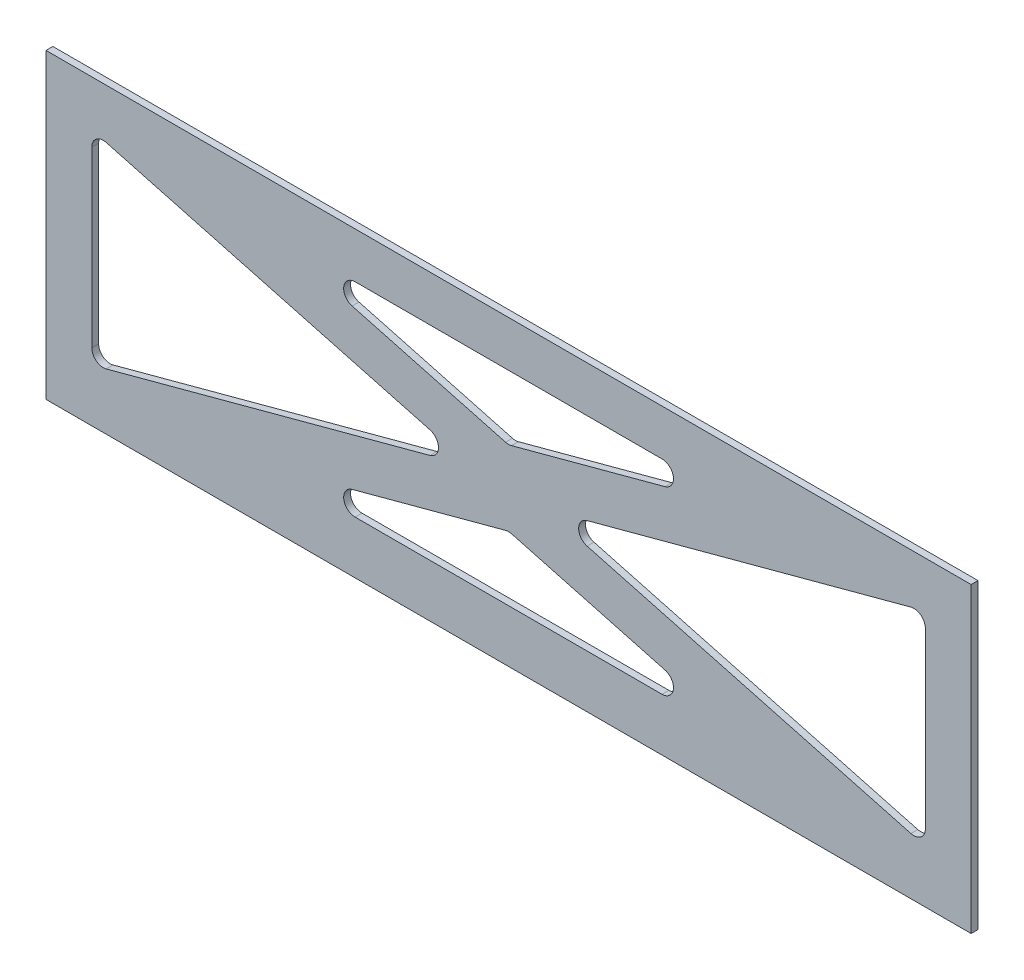
ISO-10303-21;
HEADER;
FILE_DESCRIPTION(('STEP AP214'),'2;1');
FILE_NAME('part.step','',(''),(''),'','','');
FILE_SCHEMA(('AUTOMOTIVE_DESIGN { 1 0 10303 214 1 1 1 1 }'));
ENDSEC;
DATA;
#1=APPLICATION_CONTEXT('core data for automotive mechanical design processes');
#2=APPLICATION_PROTOCOL_DEFINITION('international standard','automotive_design',2000,#1);
#3=PRODUCT_CONTEXT('',#1,'mechanical');
#4=PRODUCT('Part','Part','',(#3));
#5=PRODUCT_RELATED_PRODUCT_CATEGORY('part','',(#4));
#6=PRODUCT_DEFINITION_FORMATION('','',#4);
#7=PRODUCT_DEFINITION_CONTEXT('part definition',#1,'design');
#8=PRODUCT_DEFINITION('design','',#6,#7);
#9=PRODUCT_DEFINITION_SHAPE('','',#8);
#10=(LENGTH_UNIT() NAMED_UNIT(*) SI_UNIT(.MILLI.,.METRE.));
#11=(NAMED_UNIT(*) PLANE_ANGLE_UNIT() SI_UNIT($,.RADIAN.));
#12=(NAMED_UNIT(*) SI_UNIT($,.STERADIAN.) SOLID_ANGLE_UNIT());
#13=UNCERTAINTY_MEASURE_WITH_UNIT(LENGTH_MEASURE(1.E-05),#10,'distance_accuracy_value','');
#14=(GEOMETRIC_REPRESENTATION_CONTEXT(3) GLOBAL_UNCERTAINTY_ASSIGNED_CONTEXT((#13)) GLOBAL_UNIT_ASSIGNED_CONTEXT((#10,
#11,#12)) REPRESENTATION_CONTEXT('',''));
#15=CARTESIAN_POINT('',(0.,0.,0.));
#16=DIRECTION('',(0.,0.,1.));
#17=DIRECTION('',(1.,0.,0.));
#18=AXIS2_PLACEMENT_3D('',#15,#16,#17);
#19=CARTESIAN_POINT('',(0.,0.,154.999999999998));
#20=DIRECTION('',(0.,0.,1.));
#21=DIRECTION('',(1.,0.,0.));
#22=AXIS2_PLACEMENT_3D('',#19,#20,#21);
#23=PLANE('',#22);
#24=DIRECTION('',(0.,-1.,0.));
#25=VECTOR('',#24,1.);
#26=CARTESIAN_POINT('',(-116.473418032142,-3.40919867975124,154.999999999998));
#27=LINE('',#26,#25);
#28=CARTESIAN_POINT('',(-116.473418032142,-3.40919867975124,154.999999999998));
#29=VERTEX_POINT('',#28);
#30=CARTESIAN_POINT('',(-116.473418032142,-135.409198679751,154.999999999998));
#31=VERTEX_POINT('',#30);
#32=EDGE_CURVE('E407',#29,#31,#27,.T.);
#33=ORIENTED_EDGE('',*,*,#32,.T.);
#34=DIRECTION('',(1.,0.,0.));
#35=VECTOR('',#34,1.);
#36=CARTESIAN_POINT('',(-116.473418032142,-135.409198679751,154.999999999998));
#37=LINE('',#36,#35);
#38=CARTESIAN_POINT('',(287.526581967859,-135.409198679751,154.999999999998));
#39=VERTEX_POINT('',#38);
#40=EDGE_CURVE('E410',#31,#39,#37,.T.);
#41=ORIENTED_EDGE('',*,*,#40,.T.);
#42=DIRECTION('',(0.,1.,0.));
#43=VECTOR('',#42,1.);
#44=CARTESIAN_POINT('',(287.526581967859,-3.40919867975124,154.999999999998));
#45=LINE('',#44,#43);
#46=CARTESIAN_POINT('',(287.526581967859,-3.40919867975124,154.999999999998));
#47=VERTEX_POINT('',#46);
#48=EDGE_CURVE('E413',#39,#47,#45,.T.);
#49=ORIENTED_EDGE('',*,*,#48,.T.);
#50=DIRECTION('',(-1.,0.,0.));
#51=VECTOR('',#50,1.);
#52=CARTESIAN_POINT('',(-116.473418032142,-3.40919867975124,154.999999999998));
#53=LINE('',#52,#51);
#54=EDGE_CURVE('E415',#47,#29,#53,.T.);
#55=ORIENTED_EDGE('',*,*,#54,.T.);
#56=EDGE_LOOP('',(#33,#41,#49,#55));
#57=FACE_BOUND('',#56,.T.);
#58=DIRECTION('',(0.965769259558436,0.25940265475116,0.));
#59=VECTOR('',#58,1.);
#60=CARTESIAN_POINT('',(51.2243022304493,-72.7380449775434,154.999999999998));
#61=LINE('',#60,#59);
#62=CARTESIAN_POINT('',(-90.1764047583858,-110.717840268776,154.999999999998));
#63=VERTEX_POINT('',#62);
#64=CARTESIAN_POINT('',(51.2243022304493,-72.7380449775434,154.999999999998));
#65=VERTEX_POINT('',#64);
#66=EDGE_CURVE('E364',#63,#65,#61,.T.);
#67=ORIENTED_EDGE('',*,*,#66,.F.);
#68=CARTESIAN_POINT('',(-91.4734180321416,-105.888993970984,154.999999999998));
#69=DIRECTION('',(0.,0.,1.));
#70=DIRECTION('',(-1.,0.,0.));
#71=AXIS2_PLACEMENT_3D('',#68,#69,#70);
#72=CIRCLE('',#71,5.00000000000001);
#73=CARTESIAN_POINT('',(-96.4734180321416,-105.888993970984,154.999999999998));
#74=VERTEX_POINT('',#73);
#75=EDGE_CURVE('E362',#74,#63,#72,.T.);
#76=ORIENTED_EDGE('',*,*,#75,.F.);
#77=DIRECTION('',(0.,-1.,0.));
#78=VECTOR('',#77,1.);
#79=CARTESIAN_POINT('',(-96.4734180321416,-105.888993970984,154.999999999998));
#80=LINE('',#79,#78);
#81=CARTESIAN_POINT('',(-96.4734180321416,-29.9294033885187,154.999999999998));
#82=VERTEX_POINT('',#81);
#83=EDGE_CURVE('E374',#82,#74,#80,.T.);
#84=ORIENTED_EDGE('',*,*,#83,.F.);
#85=CARTESIAN_POINT('',(-91.4734180321416,-29.9294033885187,154.999999999998));
#86=DIRECTION('',(0.,0.,1.));
#87=DIRECTION('',(1.,0.,0.));
#88=AXIS2_PLACEMENT_3D('',#85,#86,#87);
#89=CIRCLE('',#88,5.00000000000001);
#90=CARTESIAN_POINT('',(-90.1764047583858,-25.1005570907265,154.999999999998));
#91=VERTEX_POINT('',#90);
#92=EDGE_CURVE('E371',#91,#82,#89,.T.);
#93=ORIENTED_EDGE('',*,*,#92,.F.);
#94=DIRECTION('',(-0.965769259558436,0.25940265475116,0.));
#95=VECTOR('',#94,1.);
#96=CARTESIAN_POINT('',(-90.1764047583858,-25.1005570907265,154.999999999998));
#97=LINE('',#96,#95);
#98=CARTESIAN_POINT('',(51.2243022304493,-63.0803523819591,154.999999999998));
#99=VERTEX_POINT('',#98);
#100=EDGE_CURVE('E369',#99,#91,#97,.T.);
#101=ORIENTED_EDGE('',*,*,#100,.F.);
#102=CARTESIAN_POINT('',(49.9272889566935,-67.9091986797513,154.999999999998));
#103=DIRECTION('',(0.,0.,1.));
#104=DIRECTION('',(1.,0.,0.));
#105=AXIS2_PLACEMENT_3D('',#102,#103,#104);
#106=CIRCLE('',#105,5.);
#107=EDGE_CURVE('E367',#65,#99,#106,.T.);
#108=ORIENTED_EDGE('',*,*,#107,.F.);
#109=EDGE_LOOP('',(#67,#76,#84,#93,#101,#108));
#110=FACE_BOUND('',#109,.T.);
#111=DIRECTION('',(-0.965769259558436,0.259402654751159,0.));
#112=VECTOR('',#111,1.);
#113=CARTESIAN_POINT('',(86.8235952416147,-84.5818121562467,154.999999999998));
#114=LINE('',#113,#112);
#115=CARTESIAN_POINT('',(153.833074707404,-102.580352381959,154.999999999998));
#116=VERTEX_POINT('',#115);
#117=CARTESIAN_POINT('',(86.8235952416147,-84.5818121562467,154.999999999998));
#118=VERTEX_POINT('',#117);
#119=EDGE_CURVE('E319',#116,#118,#114,.T.);
#120=ORIENTED_EDGE('',*,*,#119,.F.);
#121=CARTESIAN_POINT('',(152.536061433648,-107.409198679751,154.999999999998));
#122=DIRECTION('',(0.,0.,1.));
#123=DIRECTION('',(-1.,0.,0.));
#124=AXIS2_PLACEMENT_3D('',#121,#122,#123);
#125=CIRCLE('',#124,5.00000000000001);
#126=CARTESIAN_POINT('',(152.536061433648,-112.409198679751,154.999999999998));
#127=VERTEX_POINT('',#126);
#128=EDGE_CURVE('E317',#127,#116,#125,.T.);
#129=ORIENTED_EDGE('',*,*,#128,.F.);
#130=DIRECTION('',(1.,0.,0.));
#131=VECTOR('',#130,1.);
#132=CARTESIAN_POINT('',(152.536061433648,-112.409198679751,154.999999999998));
#133=LINE('',#132,#131);
#134=CARTESIAN_POINT('',(18.51710250207,-112.409198679751,154.999999999998));
#135=VERTEX_POINT('',#134);
#136=EDGE_CURVE('E329',#135,#127,#133,.T.);
#137=ORIENTED_EDGE('',*,*,#136,.F.);
#138=CARTESIAN_POINT('',(18.51710250207,-107.409198679751,154.999999999998));
#139=DIRECTION('',(0.,0.,1.));
#140=DIRECTION('',(1.,0.,0.));
#141=AXIS2_PLACEMENT_3D('',#138,#139,#140);
#142=CIRCLE('',#141,4.99999999999999);
#143=CARTESIAN_POINT('',(17.2200892283142,-102.580352381959,154.999999999998));
#144=VERTEX_POINT('',#143);
#145=EDGE_CURVE('E326',#144,#135,#142,.T.);
#146=ORIENTED_EDGE('',*,*,#145,.F.);
#147=DIRECTION('',(-0.965769259558436,-0.25940265475116,0.));
#148=VECTOR('',#147,1.);
#149=CARTESIAN_POINT('',(17.2200892283142,-102.580352381959,154.999999999998));
#150=LINE('',#149,#148);
#151=CARTESIAN_POINT('',(84.2295686941031,-84.5818121562467,154.999999999998));
#152=VERTEX_POINT('',#151);
#153=EDGE_CURVE('E324',#152,#144,#150,.T.);
#154=ORIENTED_EDGE('',*,*,#153,.F.);
#155=CARTESIAN_POINT('',(85.5265819678589,-89.4106584540389,154.999999999998));
#156=DIRECTION('',(0.,0.,1.));
#157=DIRECTION('',(-1.,0.,0.));
#158=AXIS2_PLACEMENT_3D('',#155,#156,#157);
#159=CIRCLE('',#158,5.00000000000001);
#160=EDGE_CURVE('E322',#118,#152,#159,.T.);
#161=ORIENTED_EDGE('',*,*,#160,.F.);
#162=EDGE_LOOP('',(#120,#129,#137,#146,#154,#161));
#163=FACE_BOUND('',#162,.T.);
#164=DIRECTION('',(0.965769259558436,-0.25940265475116,0.));
#165=VECTOR('',#164,1.);
#166=CARTESIAN_POINT('',(119.828861705269,-72.7380449775434,154.999999999998));
#167=LINE('',#166,#165);
#168=CARTESIAN_POINT('',(119.828861705269,-72.7380449775434,154.999999999998));
#169=VERTEX_POINT('',#168);
#170=CARTESIAN_POINT('',(261.229568694104,-110.717840268776,154.999999999998));
#171=VERTEX_POINT('',#170);
#172=EDGE_CURVE('E274',#169,#171,#167,.T.);
#173=ORIENTED_EDGE('',*,*,#172,.F.);
#174=CARTESIAN_POINT('',(121.125874979025,-67.9091986797512,154.999999999998));
#175=DIRECTION('',(0.,0.,1.));
#176=DIRECTION('',(1.,0.,0.));
#177=AXIS2_PLACEMENT_3D('',#174,#175,#176);
#178=CIRCLE('',#177,4.99999999999999);
#179=CARTESIAN_POINT('',(119.828861705269,-63.0803523819591,154.999999999998));
#180=VERTEX_POINT('',#179);
#181=EDGE_CURVE('E272',#180,#169,#178,.T.);
#182=ORIENTED_EDGE('',*,*,#181,.F.);
#183=DIRECTION('',(-0.965769259558437,-0.25940265475116,0.));
#184=VECTOR('',#183,1.);
#185=CARTESIAN_POINT('',(261.229568694104,-25.1005570907265,154.999999999998));
#186=LINE('',#185,#184);
#187=CARTESIAN_POINT('',(261.229568694104,-25.1005570907266,154.999999999998));
#188=VERTEX_POINT('',#187);
#189=EDGE_CURVE('E284',#188,#180,#186,.T.);
#190=ORIENTED_EDGE('',*,*,#189,.F.);
#191=CARTESIAN_POINT('',(262.526581967859,-29.9294033885187,154.999999999998));
#192=DIRECTION('',(0.,0.,1.));
#193=DIRECTION('',(1.,0.,0.));
#194=AXIS2_PLACEMENT_3D('',#191,#192,#193);
#195=CIRCLE('',#194,4.99999999999998);
#196=CARTESIAN_POINT('',(267.526581967859,-29.9294033885187,154.999999999998));
#197=VERTEX_POINT('',#196);
#198=EDGE_CURVE('E281',#197,#188,#195,.T.);
#199=ORIENTED_EDGE('',*,*,#198,.F.);
#200=DIRECTION('',(0.,1.,0.));
#201=VECTOR('',#200,1.);
#202=CARTESIAN_POINT('',(267.526581967859,-105.888993970984,154.999999999998));
#203=LINE('',#202,#201);
#204=CARTESIAN_POINT('',(267.526581967859,-105.888993970984,154.999999999998));
#205=VERTEX_POINT('',#204);
#206=EDGE_CURVE('E279',#205,#197,#203,.T.);
#207=ORIENTED_EDGE('',*,*,#206,.F.);
#208=CARTESIAN_POINT('',(262.526581967859,-105.888993970984,154.999999999998));
#209=DIRECTION('',(0.,0.,1.));
#210=DIRECTION('',(1.,0.,0.));
#211=AXIS2_PLACEMENT_3D('',#208,#209,#210);
#212=CIRCLE('',#211,5.);
#213=EDGE_CURVE('E277',#171,#205,#212,.T.);
#214=ORIENTED_EDGE('',*,*,#213,.F.);
#215=EDGE_LOOP('',(#173,#182,#190,#199,#207,#214));
#216=FACE_BOUND('',#215,.T.);
#217=DIRECTION('',(0.965769259558436,-0.25940265475116,0.));
#218=VECTOR('',#217,1.);
#219=CARTESIAN_POINT('',(17.2200892283142,-33.2380449775434,154.999999999998));
#220=LINE('',#219,#218);
#221=CARTESIAN_POINT('',(17.2200892283142,-33.2380449775434,154.999999999998));
#222=VERTEX_POINT('',#221);
#223=CARTESIAN_POINT('',(84.2295686941031,-51.2365852032558,154.999999999998));
#224=VERTEX_POINT('',#223);
#225=EDGE_CURVE('E229',#222,#224,#220,.T.);
#226=ORIENTED_EDGE('',*,*,#225,.F.);
#227=CARTESIAN_POINT('',(18.51710250207,-28.4091986797512,154.999999999998));
#228=DIRECTION('',(0.,0.,1.));
#229=DIRECTION('',(-1.,0.,0.));
#230=AXIS2_PLACEMENT_3D('',#227,#228,#229);
#231=CIRCLE('',#230,4.99999999999999);
#232=CARTESIAN_POINT('',(18.51710250207,-23.4091986797512,154.999999999998));
#233=VERTEX_POINT('',#232);
#234=EDGE_CURVE('E221',#233,#222,#231,.T.);
#235=ORIENTED_EDGE('',*,*,#234,.F.);
#236=DIRECTION('',(-1.,0.,0.));
#237=VECTOR('',#236,1.);
#238=CARTESIAN_POINT('',(152.536061433648,-23.4091986797512,154.999999999998));
#239=LINE('',#238,#237);
#240=CARTESIAN_POINT('',(152.536061433648,-23.4091986797512,154.999999999998));
#241=VERTEX_POINT('',#240);
#242=EDGE_CURVE('E250',#241,#233,#239,.T.);
#243=ORIENTED_EDGE('',*,*,#242,.F.);
#244=CARTESIAN_POINT('',(152.536061433648,-28.4091986797512,154.999999999998));
#245=DIRECTION('',(0.,0.,1.));
#246=DIRECTION('',(1.,0.,0.));
#247=AXIS2_PLACEMENT_3D('',#244,#245,#246);
#248=CIRCLE('',#247,5.00000000000001);
#249=CARTESIAN_POINT('',(153.833074707404,-33.2380449775435,154.999999999998));
#250=VERTEX_POINT('',#249);
#251=EDGE_CURVE('E248',#250,#241,#248,.T.);
#252=ORIENTED_EDGE('',*,*,#251,.F.);
#253=DIRECTION('',(0.965769259558436,0.25940265475116,0.));
#254=VECTOR('',#253,1.);
#255=CARTESIAN_POINT('',(86.8235952416147,-51.2365852032558,154.999999999998));
#256=LINE('',#255,#254);
#257=CARTESIAN_POINT('',(86.8235952416147,-51.2365852032558,154.999999999998));
#258=VERTEX_POINT('',#257);
#259=EDGE_CURVE('E244',#258,#250,#256,.T.);
#260=ORIENTED_EDGE('',*,*,#259,.F.);
#261=CARTESIAN_POINT('',(85.5265819678589,-46.4077389054636,154.999999999998));
#262=DIRECTION('',(0.,0.,1.));
#263=DIRECTION('',(-1.,0.,0.));
#264=AXIS2_PLACEMENT_3D('',#261,#262,#263);
#265=CIRCLE('',#264,5.);
#266=EDGE_CURVE('E242',#224,#258,#265,.T.);
#267=ORIENTED_EDGE('',*,*,#266,.F.);
#268=EDGE_LOOP('',(#226,#235,#243,#252,#260,#267));
#269=FACE_BOUND('',#268,.T.);
#270=ADVANCED_FACE('F36',(#57,#110,#163,#216,#269),#23,.T.);
#271=CARTESIAN_POINT('',(0.,0.,151.999999999998));
#272=DIRECTION('',(0.,0.,1.));
#273=DIRECTION('',(1.,0.,0.));
#274=AXIS2_PLACEMENT_3D('',#271,#272,#273);
#275=PLANE('',#274);
#276=CARTESIAN_POINT('',(121.125874979025,-67.9091986797512,151.999999999998));
#277=DIRECTION('',(0.,0.,1.));
#278=DIRECTION('',(1.,0.,0.));
#279=AXIS2_PLACEMENT_3D('',#276,#277,#278);
#280=CIRCLE('',#279,4.99999999999999);
#281=CARTESIAN_POINT('',(119.828861705269,-63.0803523819591,151.999999999998));
#282=VERTEX_POINT('',#281);
#283=CARTESIAN_POINT('',(119.828861705269,-72.7380449775434,151.999999999998));
#284=VERTEX_POINT('',#283);
#285=EDGE_CURVE('E237',#282,#284,#280,.T.);
#286=ORIENTED_EDGE('',*,*,#285,.T.);
#287=DIRECTION('',(0.965769259558436,-0.25940265475116,0.));
#288=VECTOR('',#287,1.);
#289=CARTESIAN_POINT('',(119.828861705269,-72.7380449775434,151.999999999998));
#290=LINE('',#289,#288);
#291=CARTESIAN_POINT('',(261.229568694104,-110.717840268776,151.999999999998));
#292=VERTEX_POINT('',#291);
#293=EDGE_CURVE('E289',#284,#292,#290,.T.);
#294=ORIENTED_EDGE('',*,*,#293,.T.);
#295=CARTESIAN_POINT('',(262.526581967859,-105.888993970984,151.999999999998));
#296=DIRECTION('',(0.,0.,1.));
#297=DIRECTION('',(1.,0.,0.));
#298=AXIS2_PLACEMENT_3D('',#295,#296,#297);
#299=CIRCLE('',#298,5.);
#300=CARTESIAN_POINT('',(267.526581967859,-105.888993970984,151.999999999998));
#301=VERTEX_POINT('',#300);
#302=EDGE_CURVE('E292',#292,#301,#299,.T.);
#303=ORIENTED_EDGE('',*,*,#302,.T.);
#304=DIRECTION('',(0.,1.,0.));
#305=VECTOR('',#304,1.);
#306=CARTESIAN_POINT('',(267.526581967859,-105.888993970984,151.999999999998));
#307=LINE('',#306,#305);
#308=CARTESIAN_POINT('',(267.526581967859,-29.9294033885187,151.999999999998));
#309=VERTEX_POINT('',#308);
#310=EDGE_CURVE('E295',#301,#309,#307,.T.);
#311=ORIENTED_EDGE('',*,*,#310,.T.);
#312=CARTESIAN_POINT('',(262.526581967859,-29.9294033885187,151.999999999998));
#313=DIRECTION('',(0.,0.,1.));
#314=DIRECTION('',(1.,0.,0.));
#315=AXIS2_PLACEMENT_3D('',#312,#313,#314);
#316=CIRCLE('',#315,4.99999999999998);
#317=CARTESIAN_POINT('',(261.229568694104,-25.1005570907265,151.999999999998));
#318=VERTEX_POINT('',#317);
#319=EDGE_CURVE('E298',#309,#318,#316,.T.);
#320=ORIENTED_EDGE('',*,*,#319,.T.);
#321=DIRECTION('',(-0.965769259558437,-0.25940265475116,0.));
#322=VECTOR('',#321,1.);
#323=CARTESIAN_POINT('',(261.229568694104,-25.1005570907265,151.999999999998));
#324=LINE('',#323,#322);
#325=EDGE_CURVE('E275',#318,#282,#324,.T.);
#326=ORIENTED_EDGE('',*,*,#325,.T.);
#327=EDGE_LOOP('',(#286,#294,#303,#311,#320,#326));
#328=FACE_BOUND('',#327,.T.);
#329=CARTESIAN_POINT('',(-91.4734180321416,-105.888993970984,151.999999999998));
#330=DIRECTION('',(0.,0.,1.));
#331=DIRECTION('',(-1.,0.,0.));
#332=AXIS2_PLACEMENT_3D('',#329,#330,#331);
#333=CIRCLE('',#332,5.00000000000001);
#334=CARTESIAN_POINT('',(-96.4734180321416,-105.888993970984,151.999999999998));
#335=VERTEX_POINT('',#334);
#336=CARTESIAN_POINT('',(-90.1764047583858,-110.717840268776,151.999999999998));
#337=VERTEX_POINT('',#336);
#338=EDGE_CURVE('E361',#335,#337,#333,.T.);
#339=ORIENTED_EDGE('',*,*,#338,.T.);
#340=DIRECTION('',(0.965769259558436,0.25940265475116,0.));
#341=VECTOR('',#340,1.);
#342=CARTESIAN_POINT('',(51.2243022304493,-72.7380449775434,151.999999999998));
#343=LINE('',#342,#341);
#344=CARTESIAN_POINT('',(51.2243022304493,-72.7380449775434,151.999999999998));
#345=VERTEX_POINT('',#344);
#346=EDGE_CURVE('E379',#337,#345,#343,.T.);
#347=ORIENTED_EDGE('',*,*,#346,.T.);
#348=CARTESIAN_POINT('',(49.9272889566935,-67.9091986797513,151.999999999998));
#349=DIRECTION('',(0.,0.,1.));
#350=DIRECTION('',(1.,0.,0.));
#351=AXIS2_PLACEMENT_3D('',#348,#349,#350);
#352=CIRCLE('',#351,5.);
#353=CARTESIAN_POINT('',(51.2243022304493,-63.0803523819591,151.999999999998));
#354=VERTEX_POINT('',#353);
#355=EDGE_CURVE('E382',#345,#354,#352,.T.);
#356=ORIENTED_EDGE('',*,*,#355,.T.);
#357=DIRECTION('',(-0.965769259558436,0.25940265475116,0.));
#358=VECTOR('',#357,1.);
#359=CARTESIAN_POINT('',(-90.1764047583858,-25.1005570907265,151.999999999998));
#360=LINE('',#359,#358);
#361=CARTESIAN_POINT('',(-90.1764047583858,-25.1005570907265,151.999999999998));
#362=VERTEX_POINT('',#361);
#363=EDGE_CURVE('E385',#354,#362,#360,.T.);
#364=ORIENTED_EDGE('',*,*,#363,.T.);
#365=CARTESIAN_POINT('',(-91.4734180321416,-29.9294033885187,151.999999999998));
#366=DIRECTION('',(0.,0.,1.));
#367=DIRECTION('',(1.,0.,0.));
#368=AXIS2_PLACEMENT_3D('',#365,#366,#367);
#369=CIRCLE('',#368,5.00000000000001);
#370=CARTESIAN_POINT('',(-96.4734180321416,-29.9294033885187,151.999999999998));
#371=VERTEX_POINT('',#370);
#372=EDGE_CURVE('E388',#362,#371,#369,.T.);
#373=ORIENTED_EDGE('',*,*,#372,.T.);
#374=DIRECTION('',(0.,-1.,0.));
#375=VECTOR('',#374,1.);
#376=CARTESIAN_POINT('',(-96.4734180321416,-105.888993970984,151.999999999998));
#377=LINE('',#376,#375);
#378=EDGE_CURVE('E365',#371,#335,#377,.T.);
#379=ORIENTED_EDGE('',*,*,#378,.T.);
#380=EDGE_LOOP('',(#339,#347,#356,#364,#373,#379));
#381=FACE_BOUND('',#380,.T.);
#382=DIRECTION('',(0.,-1.,0.));
#383=VECTOR('',#382,1.);
#384=CARTESIAN_POINT('',(-116.473418032142,-3.40919867975124,151.999999999998));
#385=LINE('',#384,#383);
#386=CARTESIAN_POINT('',(-116.473418032142,-3.40919867975124,151.999999999998));
#387=VERTEX_POINT('',#386);
#388=CARTESIAN_POINT('',(-116.473418032142,-135.409198679751,151.999999999998));
#389=VERTEX_POINT('',#388);
#390=EDGE_CURVE('E406',#387,#389,#385,.T.);
#391=ORIENTED_EDGE('',*,*,#390,.F.);
#392=DIRECTION('',(-1.,0.,0.));
#393=VECTOR('',#392,1.);
#394=CARTESIAN_POINT('',(-116.473418032142,-3.40919867975124,151.999999999998));
#395=LINE('',#394,#393);
#396=CARTESIAN_POINT('',(287.526581967859,-3.40919867975124,151.999999999998));
#397=VERTEX_POINT('',#396);
#398=EDGE_CURVE('E411',#397,#387,#395,.T.);
#399=ORIENTED_EDGE('',*,*,#398,.F.);
#400=DIRECTION('',(0.,1.,0.));
#401=VECTOR('',#400,1.);
#402=CARTESIAN_POINT('',(287.526581967859,-3.40919867975124,151.999999999998));
#403=LINE('',#402,#401);
#404=CARTESIAN_POINT('',(287.526581967859,-135.409198679751,151.999999999998));
#405=VERTEX_POINT('',#404);
#406=EDGE_CURVE('E422',#405,#397,#403,.T.);
#407=ORIENTED_EDGE('',*,*,#406,.F.);
#408=DIRECTION('',(1.,0.,0.));
#409=VECTOR('',#408,1.);
#410=CARTESIAN_POINT('',(-116.473418032142,-135.409198679751,151.999999999998));
#411=LINE('',#410,#409);
#412=EDGE_CURVE('E420',#389,#405,#411,.T.);
#413=ORIENTED_EDGE('',*,*,#412,.F.);
#414=EDGE_LOOP('',(#391,#399,#407,#413));
#415=FACE_BOUND('',#414,.T.);
#416=CARTESIAN_POINT('',(152.536061433648,-107.409198679751,151.999999999998));
#417=DIRECTION('',(0.,0.,1.));
#418=DIRECTION('',(-1.,0.,0.));
#419=AXIS2_PLACEMENT_3D('',#416,#417,#418);
#420=CIRCLE('',#419,5.00000000000001);
#421=CARTESIAN_POINT('',(152.536061433648,-112.409198679751,151.999999999998));
#422=VERTEX_POINT('',#421);
#423=CARTESIAN_POINT('',(153.833074707404,-102.580352381959,151.999999999998));
#424=VERTEX_POINT('',#423);
#425=EDGE_CURVE('E316',#422,#424,#420,.T.);
#426=ORIENTED_EDGE('',*,*,#425,.T.);
#427=DIRECTION('',(-0.965769259558436,0.259402654751159,0.));
#428=VECTOR('',#427,1.);
#429=CARTESIAN_POINT('',(86.8235952416147,-84.5818121562467,151.999999999998));
#430=LINE('',#429,#428);
#431=CARTESIAN_POINT('',(86.8235952416147,-84.5818121562467,151.999999999998));
#432=VERTEX_POINT('',#431);
#433=EDGE_CURVE('E334',#424,#432,#430,.T.);
#434=ORIENTED_EDGE('',*,*,#433,.T.);
#435=CARTESIAN_POINT('',(85.5265819678589,-89.4106584540389,151.999999999998));
#436=DIRECTION('',(0.,0.,1.));
#437=DIRECTION('',(-1.,0.,0.));
#438=AXIS2_PLACEMENT_3D('',#435,#436,#437);
#439=CIRCLE('',#438,5.00000000000001);
#440=CARTESIAN_POINT('',(84.2295686941031,-84.5818121562467,151.999999999998));
#441=VERTEX_POINT('',#440);
#442=EDGE_CURVE('E337',#432,#441,#439,.T.);
#443=ORIENTED_EDGE('',*,*,#442,.T.);
#444=DIRECTION('',(-0.965769259558436,-0.25940265475116,0.));
#445=VECTOR('',#444,1.);
#446=CARTESIAN_POINT('',(17.2200892283142,-102.580352381959,151.999999999998));
#447=LINE('',#446,#445);
#448=CARTESIAN_POINT('',(17.2200892283142,-102.580352381959,151.999999999998));
#449=VERTEX_POINT('',#448);
#450=EDGE_CURVE('E340',#441,#449,#447,.T.);
#451=ORIENTED_EDGE('',*,*,#450,.T.);
#452=CARTESIAN_POINT('',(18.51710250207,-107.409198679751,151.999999999998));
#453=DIRECTION('',(0.,0.,1.));
#454=DIRECTION('',(1.,0.,0.));
#455=AXIS2_PLACEMENT_3D('',#452,#453,#454);
#456=CIRCLE('',#455,4.99999999999999);
#457=CARTESIAN_POINT('',(18.51710250207,-112.409198679751,151.999999999998));
#458=VERTEX_POINT('',#457);
#459=EDGE_CURVE('E343',#449,#458,#456,.T.);
#460=ORIENTED_EDGE('',*,*,#459,.T.);
#461=DIRECTION('',(1.,0.,0.));
#462=VECTOR('',#461,1.);
#463=CARTESIAN_POINT('',(152.536061433648,-112.409198679751,151.999999999998));
#464=LINE('',#463,#462);
#465=EDGE_CURVE('E320',#458,#422,#464,.T.);
#466=ORIENTED_EDGE('',*,*,#465,.T.);
#467=EDGE_LOOP('',(#426,#434,#443,#451,#460,#466));
#468=FACE_BOUND('',#467,.T.);
#469=CARTESIAN_POINT('',(18.51710250207,-28.4091986797512,151.999999999998));
#470=DIRECTION('',(0.,0.,1.));
#471=DIRECTION('',(-1.,0.,0.));
#472=AXIS2_PLACEMENT_3D('',#469,#470,#471);
#473=CIRCLE('',#472,4.99999999999999);
#474=CARTESIAN_POINT('',(18.51710250207,-23.4091986797512,151.999999999998));
#475=VERTEX_POINT('',#474);
#476=CARTESIAN_POINT('',(17.2200892283142,-33.2380449775434,151.999999999998));
#477=VERTEX_POINT('',#476);
#478=EDGE_CURVE('E59',#475,#477,#473,.T.);
#479=ORIENTED_EDGE('',*,*,#478,.T.);
#480=DIRECTION('',(0.965769259558436,-0.25940265475116,0.));
#481=VECTOR('',#480,1.);
#482=CARTESIAN_POINT('',(17.2200892283142,-33.2380449775434,151.999999999998));
#483=LINE('',#482,#481);
#484=CARTESIAN_POINT('',(84.2295686941031,-51.2365852032558,151.999999999998));
#485=VERTEX_POINT('',#484);
#486=EDGE_CURVE('E236',#477,#485,#483,.T.);
#487=ORIENTED_EDGE('',*,*,#486,.T.);
#488=CARTESIAN_POINT('',(85.5265819678589,-46.4077389054636,151.999999999998));
#489=DIRECTION('',(0.,0.,1.));
#490=DIRECTION('',(-1.,0.,0.));
#491=AXIS2_PLACEMENT_3D('',#488,#489,#490);
#492=CIRCLE('',#491,5.);
#493=CARTESIAN_POINT('',(86.8235952416147,-51.2365852032558,151.999999999998));
#494=VERTEX_POINT('',#493);
#495=EDGE_CURVE('E254',#485,#494,#492,.T.);
#496=ORIENTED_EDGE('',*,*,#495,.T.);
#497=DIRECTION('',(0.965769259558436,0.25940265475116,0.));
#498=VECTOR('',#497,1.);
#499=CARTESIAN_POINT('',(86.8235952416147,-51.2365852032558,151.999999999998));
#500=LINE('',#499,#498);
#501=CARTESIAN_POINT('',(153.833074707404,-33.2380449775435,151.999999999998));
#502=VERTEX_POINT('',#501);
#503=EDGE_CURVE('E257',#494,#502,#500,.T.);
#504=ORIENTED_EDGE('',*,*,#503,.T.);
#505=CARTESIAN_POINT('',(152.536061433648,-28.4091986797512,151.999999999998));
#506=DIRECTION('',(0.,0.,1.));
#507=DIRECTION('',(1.,0.,0.));
#508=AXIS2_PLACEMENT_3D('',#505,#506,#507);
#509=CIRCLE('',#508,5.00000000000001);
#510=CARTESIAN_POINT('',(152.536061433648,-23.4091986797512,151.999999999998));
#511=VERTEX_POINT('',#510);
#512=EDGE_CURVE('E260',#502,#511,#509,.T.);
#513=ORIENTED_EDGE('',*,*,#512,.T.);
#514=DIRECTION('',(-1.,0.,0.));
#515=VECTOR('',#514,1.);
#516=CARTESIAN_POINT('',(152.536061433648,-23.4091986797512,151.999999999998));
#517=LINE('',#516,#515);
#518=EDGE_CURVE('E230',#511,#475,#517,.T.);
#519=ORIENTED_EDGE('',*,*,#518,.T.);
#520=EDGE_LOOP('',(#479,#487,#496,#504,#513,#519));
#521=FACE_BOUND('',#520,.T.);
#522=ADVANCED_FACE('F440',(#328,#381,#415,#468,#521),#275,.F.);
#523=CARTESIAN_POINT('',(-116.473418032142,-3.40919867975124,154.999999999998));
#524=DIRECTION('',(1.,0.,0.));
#525=DIRECTION('',(0.,0.,-1.));
#526=AXIS2_PLACEMENT_3D('',#523,#524,#525);
#527=PLANE('',#526);
#528=ORIENTED_EDGE('',*,*,#390,.T.);
#529=DIRECTION('',(0.,0.,-1.));
#530=VECTOR('',#529,1.);
#531=CARTESIAN_POINT('',(-116.473418032142,-135.409198679751,154.999999999998));
#532=LINE('',#531,#530);
#533=EDGE_CURVE('E11',#31,#389,#532,.T.);
#534=ORIENTED_EDGE('',*,*,#533,.F.);
#535=ORIENTED_EDGE('',*,*,#32,.F.);
#536=DIRECTION('',(0.,0.,-1.));
#537=VECTOR('',#536,1.);
#538=CARTESIAN_POINT('',(-116.473418032142,-3.40919867975124,154.999999999998));
#539=LINE('',#538,#537);
#540=EDGE_CURVE('E417',#29,#387,#539,.T.);
#541=ORIENTED_EDGE('',*,*,#540,.T.);
#542=EDGE_LOOP('',(#528,#534,#535,#541));
#543=FACE_BOUND('',#542,.T.);
#544=ADVANCED_FACE('F38',(#543),#527,.F.);
#545=CARTESIAN_POINT('',(-116.473418032142,-135.409198679751,154.999999999998));
#546=DIRECTION('',(0.,1.,0.));
#547=DIRECTION('',(-1.,0.,0.));
#548=AXIS2_PLACEMENT_3D('',#545,#546,#547);
#549=PLANE('',#548);
#550=ORIENTED_EDGE('',*,*,#412,.T.);
#551=DIRECTION('',(0.,0.,-1.));
#552=VECTOR('',#551,1.);
#553=CARTESIAN_POINT('',(287.526581967859,-135.409198679751,154.999999999998));
#554=LINE('',#553,#552);
#555=EDGE_CURVE('E44',#39,#405,#554,.T.);
#556=ORIENTED_EDGE('',*,*,#555,.F.);
#557=ORIENTED_EDGE('',*,*,#40,.F.);
#558=ORIENTED_EDGE('',*,*,#533,.T.);
#559=EDGE_LOOP('',(#550,#556,#557,#558));
#560=FACE_BOUND('',#559,.T.);
#561=ADVANCED_FACE('F451',(#560),#549,.F.);
#562=CARTESIAN_POINT('',(287.526581967859,-3.40919867975124,154.999999999998));
#563=DIRECTION('',(-1.,0.,0.));
#564=DIRECTION('',(0.,0.,1.));
#565=AXIS2_PLACEMENT_3D('',#562,#563,#564);
#566=PLANE('',#565);
#567=ORIENTED_EDGE('',*,*,#406,.T.);
#568=DIRECTION('',(0.,0.,-1.));
#569=VECTOR('',#568,1.);
#570=CARTESIAN_POINT('',(287.526581967859,-3.40919867975124,154.999999999998));
#571=LINE('',#570,#569);
#572=EDGE_CURVE('E427',#47,#397,#571,.T.);
#573=ORIENTED_EDGE('',*,*,#572,.F.);
#574=ORIENTED_EDGE('',*,*,#48,.F.);
#575=ORIENTED_EDGE('',*,*,#555,.T.);
#576=EDGE_LOOP('',(#567,#573,#574,#575));
#577=FACE_BOUND('',#576,.T.);
#578=ADVANCED_FACE('F434',(#577),#566,.F.);
#579=CARTESIAN_POINT('',(-116.473418032142,-3.40919867975124,154.999999999998));
#580=DIRECTION('',(0.,-1.,0.));
#581=DIRECTION('',(0.,0.,-1.));
#582=AXIS2_PLACEMENT_3D('',#579,#580,#581);
#583=PLANE('',#582);
#584=ORIENTED_EDGE('',*,*,#398,.T.);
#585=ORIENTED_EDGE('',*,*,#540,.F.);
#586=ORIENTED_EDGE('',*,*,#54,.F.);
#587=ORIENTED_EDGE('',*,*,#572,.T.);
#588=EDGE_LOOP('',(#584,#585,#586,#587));
#589=FACE_BOUND('',#588,.T.);
#590=ADVANCED_FACE('F444',(#589),#583,.F.);
#591=CARTESIAN_POINT('',(-91.4734180321416,-105.888993970984,154.999999999998));
#592=DIRECTION('',(0.,0.,-1.));
#593=DIRECTION('',(-1.,0.,0.));
#594=AXIS2_PLACEMENT_3D('',#591,#592,#593);
#595=CYLINDRICAL_SURFACE('',#594,5.00000000000001);
#596=ORIENTED_EDGE('',*,*,#338,.F.);
#597=DIRECTION('',(0.,0.,-1.));
#598=VECTOR('',#597,1.);
#599=CARTESIAN_POINT('',(-96.4734180321416,-105.888993970984,154.999999999998));
#600=LINE('',#599,#598);
#601=EDGE_CURVE('E376',#74,#335,#600,.T.);
#602=ORIENTED_EDGE('',*,*,#601,.F.);
#603=ORIENTED_EDGE('',*,*,#75,.T.);
#604=DIRECTION('',(0.,0.,-1.));
#605=VECTOR('',#604,1.);
#606=CARTESIAN_POINT('',(-90.1764047583858,-110.717840268776,154.999999999998));
#607=LINE('',#606,#605);
#608=EDGE_CURVE('E403',#63,#337,#607,.T.);
#609=ORIENTED_EDGE('',*,*,#608,.T.);
#610=EDGE_LOOP('',(#596,#602,#603,#609));
#611=FACE_BOUND('',#610,.T.);
#612=ADVANCED_FACE('F466',(#611),#595,.F.);
#613=CARTESIAN_POINT('',(51.2243022304493,-72.7380449775434,154.999999999998));
#614=DIRECTION('',(-0.25940265475116,0.965769259558436,0.));
#615=DIRECTION('',(-0.965769259558437,-0.25940265475116,0.));
#616=AXIS2_PLACEMENT_3D('',#613,#614,#615);
#617=PLANE('',#616);
#618=ORIENTED_EDGE('',*,*,#346,.F.);
#619=ORIENTED_EDGE('',*,*,#608,.F.);
#620=ORIENTED_EDGE('',*,*,#66,.T.);
#621=DIRECTION('',(0.,0.,-1.));
#622=VECTOR('',#621,1.);
#623=CARTESIAN_POINT('',(51.2243022304493,-72.7380449775434,154.999999999998));
#624=LINE('',#623,#622);
#625=EDGE_CURVE('E401',#65,#345,#624,.T.);
#626=ORIENTED_EDGE('',*,*,#625,.T.);
#627=EDGE_LOOP('',(#618,#619,#620,#626));
#628=FACE_BOUND('',#627,.T.);
#629=ADVANCED_FACE('F473',(#628),#617,.T.);
#630=CARTESIAN_POINT('',(49.9272889566935,-67.9091986797513,154.999999999998));
#631=DIRECTION('',(0.,0.,-1.));
#632=DIRECTION('',(-1.,0.,0.));
#633=AXIS2_PLACEMENT_3D('',#630,#631,#632);
#634=CYLINDRICAL_SURFACE('',#633,5.);
#635=ORIENTED_EDGE('',*,*,#355,.F.);
#636=ORIENTED_EDGE('',*,*,#625,.F.);
#637=ORIENTED_EDGE('',*,*,#107,.T.);
#638=DIRECTION('',(0.,0.,-1.));
#639=VECTOR('',#638,1.);
#640=CARTESIAN_POINT('',(51.2243022304493,-63.0803523819591,154.999999999998));
#641=LINE('',#640,#639);
#642=EDGE_CURVE('E399',#99,#354,#641,.T.);
#643=ORIENTED_EDGE('',*,*,#642,.T.);
#644=EDGE_LOOP('',(#635,#636,#637,#643));
#645=FACE_BOUND('',#644,.T.);
#646=ADVANCED_FACE('F478',(#645),#634,.F.);
#647=CARTESIAN_POINT('',(-90.1764047583858,-25.1005570907265,154.999999999998));
#648=DIRECTION('',(-0.25940265475116,-0.965769259558436,0.));
#649=DIRECTION('',(0.965769259558437,-0.25940265475116,0.));
#650=AXIS2_PLACEMENT_3D('',#647,#648,#649);
#651=PLANE('',#650);
#652=ORIENTED_EDGE('',*,*,#363,.F.);
#653=ORIENTED_EDGE('',*,*,#642,.F.);
#654=ORIENTED_EDGE('',*,*,#100,.T.);
#655=DIRECTION('',(0.,0.,-1.));
#656=VECTOR('',#655,1.);
#657=CARTESIAN_POINT('',(-90.1764047583858,-25.1005570907265,154.999999999998));
#658=LINE('',#657,#656);
#659=EDGE_CURVE('E397',#91,#362,#658,.T.);
#660=ORIENTED_EDGE('',*,*,#659,.T.);
#661=EDGE_LOOP('',(#652,#653,#654,#660));
#662=FACE_BOUND('',#661,.T.);
#663=ADVANCED_FACE('F503',(#662),#651,.T.);
#664=CARTESIAN_POINT('',(-91.4734180321416,-29.9294033885187,154.999999999998));
#665=DIRECTION('',(0.,0.,-1.));
#666=DIRECTION('',(-1.,0.,0.));
#667=AXIS2_PLACEMENT_3D('',#664,#665,#666);
#668=CYLINDRICAL_SURFACE('',#667,5.00000000000001);
#669=ORIENTED_EDGE('',*,*,#372,.F.);
#670=ORIENTED_EDGE('',*,*,#659,.F.);
#671=ORIENTED_EDGE('',*,*,#92,.T.);
#672=DIRECTION('',(0.,0.,-1.));
#673=VECTOR('',#672,1.);
#674=CARTESIAN_POINT('',(-96.4734180321416,-29.9294033885187,154.999999999998));
#675=LINE('',#674,#673);
#676=EDGE_CURVE('E395',#82,#371,#675,.T.);
#677=ORIENTED_EDGE('',*,*,#676,.T.);
#678=EDGE_LOOP('',(#669,#670,#671,#677));
#679=FACE_BOUND('',#678,.T.);
#680=ADVANCED_FACE('F492',(#679),#668,.F.);
#681=CARTESIAN_POINT('',(-96.4734180321416,-105.888993970984,154.999999999998));
#682=DIRECTION('',(1.,0.,0.));
#683=DIRECTION('',(0.,0.,-1.));
#684=AXIS2_PLACEMENT_3D('',#681,#682,#683);
#685=PLANE('',#684);
#686=ORIENTED_EDGE('',*,*,#378,.F.);
#687=ORIENTED_EDGE('',*,*,#676,.F.);
#688=ORIENTED_EDGE('',*,*,#83,.T.);
#689=ORIENTED_EDGE('',*,*,#601,.T.);
#690=EDGE_LOOP('',(#686,#687,#688,#689));
#691=FACE_BOUND('',#690,.T.);
#692=ADVANCED_FACE('F486',(#691),#685,.T.);
#693=CARTESIAN_POINT('',(152.536061433648,-107.409198679751,154.999999999998));
#694=DIRECTION('',(0.,0.,-1.));
#695=DIRECTION('',(-1.,0.,0.));
#696=AXIS2_PLACEMENT_3D('',#693,#694,#695);
#697=CYLINDRICAL_SURFACE('',#696,5.00000000000001);
#698=ORIENTED_EDGE('',*,*,#425,.F.);
#699=DIRECTION('',(0.,0.,-1.));
#700=VECTOR('',#699,1.);
#701=CARTESIAN_POINT('',(152.536061433648,-112.409198679751,154.999999999998));
#702=LINE('',#701,#700);
#703=EDGE_CURVE('E331',#127,#422,#702,.T.);
#704=ORIENTED_EDGE('',*,*,#703,.F.);
#705=ORIENTED_EDGE('',*,*,#128,.T.);
#706=DIRECTION('',(0.,0.,-1.));
#707=VECTOR('',#706,1.);
#708=CARTESIAN_POINT('',(153.833074707404,-102.580352381959,154.999999999998));
#709=LINE('',#708,#707);
#710=EDGE_CURVE('E358',#116,#424,#709,.T.);
#711=ORIENTED_EDGE('',*,*,#710,.T.);
#712=EDGE_LOOP('',(#698,#704,#705,#711));
#713=FACE_BOUND('',#712,.T.);
#714=ADVANCED_FACE('F515',(#713),#697,.F.);
#715=CARTESIAN_POINT('',(86.8235952416147,-84.5818121562467,154.999999999998));
#716=DIRECTION('',(-0.259402654751159,-0.965769259558437,0.));
#717=DIRECTION('',(0.965769259558437,-0.25940265475116,0.));
#718=AXIS2_PLACEMENT_3D('',#715,#716,#717);
#719=PLANE('',#718);
#720=ORIENTED_EDGE('',*,*,#433,.F.);
#721=ORIENTED_EDGE('',*,*,#710,.F.);
#722=ORIENTED_EDGE('',*,*,#119,.T.);
#723=DIRECTION('',(0.,0.,-1.));
#724=VECTOR('',#723,1.);
#725=CARTESIAN_POINT('',(86.8235952416147,-84.5818121562467,154.999999999998));
#726=LINE('',#725,#724);
#727=EDGE_CURVE('E356',#118,#432,#726,.T.);
#728=ORIENTED_EDGE('',*,*,#727,.T.);
#729=EDGE_LOOP('',(#720,#721,#722,#728));
#730=FACE_BOUND('',#729,.T.);
#731=ADVANCED_FACE('F518',(#730),#719,.T.);
#732=CARTESIAN_POINT('',(85.5265819678589,-89.4106584540389,154.999999999998));
#733=DIRECTION('',(0.,0.,-1.));
#734=DIRECTION('',(-1.,0.,0.));
#735=AXIS2_PLACEMENT_3D('',#732,#733,#734);
#736=CYLINDRICAL_SURFACE('',#735,5.00000000000001);
#737=ORIENTED_EDGE('',*,*,#442,.F.);
#738=ORIENTED_EDGE('',*,*,#727,.F.);
#739=ORIENTED_EDGE('',*,*,#160,.T.);
#740=DIRECTION('',(0.,0.,-1.));
#741=VECTOR('',#740,1.);
#742=CARTESIAN_POINT('',(84.2295686941031,-84.5818121562467,154.999999999998));
#743=LINE('',#742,#741);
#744=EDGE_CURVE('E354',#152,#441,#743,.T.);
#745=ORIENTED_EDGE('',*,*,#744,.T.);
#746=EDGE_LOOP('',(#737,#738,#739,#745));
#747=FACE_BOUND('',#746,.T.);
#748=ADVANCED_FACE('F522',(#747),#736,.F.);
#749=CARTESIAN_POINT('',(17.2200892283142,-102.580352381959,154.999999999998));
#750=DIRECTION('',(0.25940265475116,-0.965769259558436,0.));
#751=DIRECTION('',(0.965769259558437,0.25940265475116,0.));
#752=AXIS2_PLACEMENT_3D('',#749,#750,#751);
#753=PLANE('',#752);
#754=ORIENTED_EDGE('',*,*,#450,.F.);
#755=ORIENTED_EDGE('',*,*,#744,.F.);
#756=ORIENTED_EDGE('',*,*,#153,.T.);
#757=DIRECTION('',(0.,0.,-1.));
#758=VECTOR('',#757,1.);
#759=CARTESIAN_POINT('',(17.2200892283142,-102.580352381959,154.999999999998));
#760=LINE('',#759,#758);
#761=EDGE_CURVE('E352',#144,#449,#760,.T.);
#762=ORIENTED_EDGE('',*,*,#761,.T.);
#763=EDGE_LOOP('',(#754,#755,#756,#762));
#764=FACE_BOUND('',#763,.T.);
#765=ADVANCED_FACE('F526',(#764),#753,.T.);
#766=CARTESIAN_POINT('',(18.51710250207,-107.409198679751,154.999999999998));
#767=DIRECTION('',(0.,0.,-1.));
#768=DIRECTION('',(-1.,0.,0.));
#769=AXIS2_PLACEMENT_3D('',#766,#767,#768);
#770=CYLINDRICAL_SURFACE('',#769,4.99999999999999);
#771=ORIENTED_EDGE('',*,*,#459,.F.);
#772=ORIENTED_EDGE('',*,*,#761,.F.);
#773=ORIENTED_EDGE('',*,*,#145,.T.);
#774=DIRECTION('',(0.,0.,-1.));
#775=VECTOR('',#774,1.);
#776=CARTESIAN_POINT('',(18.51710250207,-112.409198679751,154.999999999998));
#777=LINE('',#776,#775);
#778=EDGE_CURVE('E350',#135,#458,#777,.T.);
#779=ORIENTED_EDGE('',*,*,#778,.T.);
#780=EDGE_LOOP('',(#771,#772,#773,#779));
#781=FACE_BOUND('',#780,.T.);
#782=ADVANCED_FACE('F530',(#781),#770,.F.);
#783=CARTESIAN_POINT('',(152.536061433648,-112.409198679751,154.999999999998));
#784=DIRECTION('',(0.,1.,0.));
#785=DIRECTION('',(0.,0.,1.));
#786=AXIS2_PLACEMENT_3D('',#783,#784,#785);
#787=PLANE('',#786);
#788=ORIENTED_EDGE('',*,*,#465,.F.);
#789=ORIENTED_EDGE('',*,*,#778,.F.);
#790=ORIENTED_EDGE('',*,*,#136,.T.);
#791=ORIENTED_EDGE('',*,*,#703,.T.);
#792=EDGE_LOOP('',(#788,#789,#790,#791));
#793=FACE_BOUND('',#792,.T.);
#794=ADVANCED_FACE('F534',(#793),#787,.T.);
#795=CARTESIAN_POINT('',(121.125874979025,-67.9091986797512,154.999999999998));
#796=DIRECTION('',(0.,0.,-1.));
#797=DIRECTION('',(-1.,0.,0.));
#798=AXIS2_PLACEMENT_3D('',#795,#796,#797);
#799=CYLINDRICAL_SURFACE('',#798,4.99999999999999);
#800=ORIENTED_EDGE('',*,*,#285,.F.);
#801=DIRECTION('',(0.,0.,-1.));
#802=VECTOR('',#801,1.);
#803=CARTESIAN_POINT('',(119.828861705269,-63.0803523819591,154.999999999998));
#804=LINE('',#803,#802);
#805=EDGE_CURVE('E286',#180,#282,#804,.T.);
#806=ORIENTED_EDGE('',*,*,#805,.F.);
#807=ORIENTED_EDGE('',*,*,#181,.T.);
#808=DIRECTION('',(0.,0.,-1.));
#809=VECTOR('',#808,1.);
#810=CARTESIAN_POINT('',(119.828861705269,-72.7380449775434,154.999999999998));
#811=LINE('',#810,#809);
#812=EDGE_CURVE('E313',#169,#284,#811,.T.);
#813=ORIENTED_EDGE('',*,*,#812,.T.);
#814=EDGE_LOOP('',(#800,#806,#807,#813));
#815=FACE_BOUND('',#814,.T.);
#816=ADVANCED_FACE('F538',(#815),#799,.F.);
#817=CARTESIAN_POINT('',(119.828861705269,-72.7380449775434,154.999999999998));
#818=DIRECTION('',(0.25940265475116,0.965769259558436,0.));
#819=DIRECTION('',(-0.965769259558437,0.25940265475116,0.));
#820=AXIS2_PLACEMENT_3D('',#817,#818,#819);
#821=PLANE('',#820);
#822=ORIENTED_EDGE('',*,*,#293,.F.);
#823=ORIENTED_EDGE('',*,*,#812,.F.);
#824=ORIENTED_EDGE('',*,*,#172,.T.);
#825=DIRECTION('',(0.,0.,-1.));
#826=VECTOR('',#825,1.);
#827=CARTESIAN_POINT('',(261.229568694104,-110.717840268776,154.999999999998));
#828=LINE('',#827,#826);
#829=EDGE_CURVE('E311',#171,#292,#828,.T.);
#830=ORIENTED_EDGE('',*,*,#829,.T.);
#831=EDGE_LOOP('',(#822,#823,#824,#830));
#832=FACE_BOUND('',#831,.T.);
#833=ADVANCED_FACE('F542',(#832),#821,.T.);
#834=CARTESIAN_POINT('',(262.526581967859,-105.888993970984,154.999999999998));
#835=DIRECTION('',(0.,0.,-1.));
#836=DIRECTION('',(-1.,0.,0.));
#837=AXIS2_PLACEMENT_3D('',#834,#835,#836);
#838=CYLINDRICAL_SURFACE('',#837,5.);
#839=ORIENTED_EDGE('',*,*,#302,.F.);
#840=ORIENTED_EDGE('',*,*,#829,.F.);
#841=ORIENTED_EDGE('',*,*,#213,.T.);
#842=DIRECTION('',(0.,0.,-1.));
#843=VECTOR('',#842,1.);
#844=CARTESIAN_POINT('',(267.526581967859,-105.888993970984,154.999999999998));
#845=LINE('',#844,#843);
#846=EDGE_CURVE('E309',#205,#301,#845,.T.);
#847=ORIENTED_EDGE('',*,*,#846,.T.);
#848=EDGE_LOOP('',(#839,#840,#841,#847));
#849=FACE_BOUND('',#848,.T.);
#850=ADVANCED_FACE('F546',(#849),#838,.F.);
#851=CARTESIAN_POINT('',(267.526581967859,-105.888993970984,154.999999999998));
#852=DIRECTION('',(-1.,0.,0.));
#853=DIRECTION('',(0.,-1.,0.));
#854=AXIS2_PLACEMENT_3D('',#851,#852,#853);
#855=PLANE('',#854);
#856=ORIENTED_EDGE('',*,*,#310,.F.);
#857=ORIENTED_EDGE('',*,*,#846,.F.);
#858=ORIENTED_EDGE('',*,*,#206,.T.);
#859=DIRECTION('',(0.,0.,-1.));
#860=VECTOR('',#859,1.);
#861=CARTESIAN_POINT('',(267.526581967859,-29.9294033885187,154.999999999998));
#862=LINE('',#861,#860);
#863=EDGE_CURVE('E307',#197,#309,#862,.T.);
#864=ORIENTED_EDGE('',*,*,#863,.T.);
#865=EDGE_LOOP('',(#856,#857,#858,#864));
#866=FACE_BOUND('',#865,.T.);
#867=ADVANCED_FACE('F550',(#866),#855,.T.);
#868=CARTESIAN_POINT('',(262.526581967859,-29.9294033885187,154.999999999998));
#869=DIRECTION('',(0.,0.,-1.));
#870=DIRECTION('',(-1.,0.,0.));
#871=AXIS2_PLACEMENT_3D('',#868,#869,#870);
#872=CYLINDRICAL_SURFACE('',#871,4.99999999999998);
#873=ORIENTED_EDGE('',*,*,#319,.F.);
#874=ORIENTED_EDGE('',*,*,#863,.F.);
#875=ORIENTED_EDGE('',*,*,#198,.T.);
#876=DIRECTION('',(0.,0.,-1.));
#877=VECTOR('',#876,1.);
#878=CARTESIAN_POINT('',(261.229568694104,-25.1005570907265,154.999999999998));
#879=LINE('',#878,#877);
#880=EDGE_CURVE('E305',#188,#318,#879,.T.);
#881=ORIENTED_EDGE('',*,*,#880,.T.);
#882=EDGE_LOOP('',(#873,#874,#875,#881));
#883=FACE_BOUND('',#882,.T.);
#884=ADVANCED_FACE('F554',(#883),#872,.F.);
#885=CARTESIAN_POINT('',(261.229568694104,-25.1005570907265,154.999999999998));
#886=DIRECTION('',(0.25940265475116,-0.965769259558437,0.));
#887=DIRECTION('',(0.965769259558437,0.25940265475116,0.));
#888=AXIS2_PLACEMENT_3D('',#885,#886,#887);
#889=PLANE('',#888);
#890=ORIENTED_EDGE('',*,*,#325,.F.);
#891=ORIENTED_EDGE('',*,*,#880,.F.);
#892=ORIENTED_EDGE('',*,*,#189,.T.);
#893=ORIENTED_EDGE('',*,*,#805,.T.);
#894=EDGE_LOOP('',(#890,#891,#892,#893));
#895=FACE_BOUND('',#894,.T.);
#896=ADVANCED_FACE('F558',(#895),#889,.T.);
#897=CARTESIAN_POINT('',(18.51710250207,-28.4091986797512,154.999999999998));
#898=DIRECTION('',(0.,0.,-1.));
#899=DIRECTION('',(-1.,0.,0.));
#900=AXIS2_PLACEMENT_3D('',#897,#898,#899);
#901=CYLINDRICAL_SURFACE('',#900,4.99999999999999);
#902=ORIENTED_EDGE('',*,*,#478,.F.);
#903=DIRECTION('',(0.,0.,-1.));
#904=VECTOR('',#903,1.);
#905=CARTESIAN_POINT('',(18.51710250207,-23.4091986797512,154.999999999998));
#906=LINE('',#905,#904);
#907=EDGE_CURVE('E225',#233,#475,#906,.T.);
#908=ORIENTED_EDGE('',*,*,#907,.F.);
#909=ORIENTED_EDGE('',*,*,#234,.T.);
#910=DIRECTION('',(0.,0.,-1.));
#911=VECTOR('',#910,1.);
#912=CARTESIAN_POINT('',(17.2200892283142,-33.2380449775434,154.999999999998));
#913=LINE('',#912,#911);
#914=EDGE_CURVE('E224',#222,#477,#913,.T.);
#915=ORIENTED_EDGE('',*,*,#914,.T.);
#916=EDGE_LOOP('',(#902,#908,#909,#915));
#917=FACE_BOUND('',#916,.T.);
#918=ADVANCED_FACE('F223',(#917),#901,.F.);
#919=CARTESIAN_POINT('',(17.2200892283142,-33.2380449775434,154.999999999998));
#920=DIRECTION('',(0.25940265475116,0.965769259558436,0.));
#921=DIRECTION('',(-0.965769259558437,0.25940265475116,0.));
#922=AXIS2_PLACEMENT_3D('',#919,#920,#921);
#923=PLANE('',#922);
#924=ORIENTED_EDGE('',*,*,#486,.F.);
#925=ORIENTED_EDGE('',*,*,#914,.F.);
#926=ORIENTED_EDGE('',*,*,#225,.T.);
#927=DIRECTION('',(0.,0.,-1.));
#928=VECTOR('',#927,1.);
#929=CARTESIAN_POINT('',(84.2295686941031,-51.2365852032558,154.999999999998));
#930=LINE('',#929,#928);
#931=EDGE_CURVE('E238',#224,#485,#930,.T.);
#932=ORIENTED_EDGE('',*,*,#931,.T.);
#933=EDGE_LOOP('',(#924,#925,#926,#932));
#934=FACE_BOUND('',#933,.T.);
#935=ADVANCED_FACE('F233',(#934),#923,.T.);
#936=CARTESIAN_POINT('',(85.5265819678589,-46.4077389054636,154.999999999998));
#937=DIRECTION('',(0.,0.,-1.));
#938=DIRECTION('',(-1.,0.,0.));
#939=AXIS2_PLACEMENT_3D('',#936,#937,#938);
#940=CYLINDRICAL_SURFACE('',#939,5.);
#941=ORIENTED_EDGE('',*,*,#495,.F.);
#942=ORIENTED_EDGE('',*,*,#931,.F.);
#943=ORIENTED_EDGE('',*,*,#266,.T.);
#944=DIRECTION('',(0.,0.,-1.));
#945=VECTOR('',#944,1.);
#946=CARTESIAN_POINT('',(86.8235952416147,-51.2365852032558,154.999999999998));
#947=LINE('',#946,#945);
#948=EDGE_CURVE('E269',#258,#494,#947,.T.);
#949=ORIENTED_EDGE('',*,*,#948,.T.);
#950=EDGE_LOOP('',(#941,#942,#943,#949));
#951=FACE_BOUND('',#950,.T.);
#952=ADVANCED_FACE('F567',(#951),#940,.F.);
#953=CARTESIAN_POINT('',(86.8235952416147,-51.2365852032558,154.999999999998));
#954=DIRECTION('',(-0.25940265475116,0.965769259558437,0.));
#955=DIRECTION('',(-0.965769259558437,-0.25940265475116,0.));
#956=AXIS2_PLACEMENT_3D('',#953,#954,#955);
#957=PLANE('',#956);
#958=ORIENTED_EDGE('',*,*,#503,.F.);
#959=ORIENTED_EDGE('',*,*,#948,.F.);
#960=ORIENTED_EDGE('',*,*,#259,.T.);
#961=DIRECTION('',(0.,0.,-1.));
#962=VECTOR('',#961,1.);
#963=CARTESIAN_POINT('',(153.833074707404,-33.2380449775435,154.999999999998));
#964=LINE('',#963,#962);
#965=EDGE_CURVE('E267',#250,#502,#964,.T.);
#966=ORIENTED_EDGE('',*,*,#965,.T.);
#967=EDGE_LOOP('',(#958,#959,#960,#966));
#968=FACE_BOUND('',#967,.T.);
#969=ADVANCED_FACE('F570',(#968),#957,.T.);
#970=CARTESIAN_POINT('',(152.536061433648,-28.4091986797512,154.999999999998));
#971=DIRECTION('',(0.,0.,-1.));
#972=DIRECTION('',(-1.,0.,0.));
#973=AXIS2_PLACEMENT_3D('',#970,#971,#972);
#974=CYLINDRICAL_SURFACE('',#973,5.00000000000001);
#975=ORIENTED_EDGE('',*,*,#512,.F.);
#976=ORIENTED_EDGE('',*,*,#965,.F.);
#977=ORIENTED_EDGE('',*,*,#251,.T.);
#978=DIRECTION('',(0.,0.,-1.));
#979=VECTOR('',#978,1.);
#980=CARTESIAN_POINT('',(152.536061433648,-23.4091986797512,154.999999999998));
#981=LINE('',#980,#979);
#982=EDGE_CURVE('E51',#241,#511,#981,.T.);
#983=ORIENTED_EDGE('',*,*,#982,.T.);
#984=EDGE_LOOP('',(#975,#976,#977,#983));
#985=FACE_BOUND('',#984,.T.);
#986=ADVANCED_FACE('F574',(#985),#974,.F.);
#987=CARTESIAN_POINT('',(152.536061433648,-23.4091986797512,154.999999999998));
#988=DIRECTION('',(0.,-1.,0.));
#989=DIRECTION('',(0.,0.,-1.));
#990=AXIS2_PLACEMENT_3D('',#987,#988,#989);
#991=PLANE('',#990);
#992=ORIENTED_EDGE('',*,*,#518,.F.);
#993=ORIENTED_EDGE('',*,*,#982,.F.);
#994=ORIENTED_EDGE('',*,*,#242,.T.);
#995=ORIENTED_EDGE('',*,*,#907,.T.);
#996=EDGE_LOOP('',(#992,#993,#994,#995));
#997=FACE_BOUND('',#996,.T.);
#998=ADVANCED_FACE('F578',(#997),#991,.T.);
#999=CLOSED_SHELL('',(#270,#522,#544,#561,#578,#590,#612,#629,#646,#663,#680,#692,#714,#731,
#748,#765,#782,#794,#816,#833,#850,#867,#884,#896,#918,#935,#952,#969,#986,#998));
#1000=MANIFOLD_SOLID_BREP('B2',#999);
#1001=ADVANCED_BREP_SHAPE_REPRESENTATION('',(#18,#1000),#14);
#1002=SHAPE_DEFINITION_REPRESENTATION(#9,#1001);
ENDSEC;
END-ISO-10303-21;
